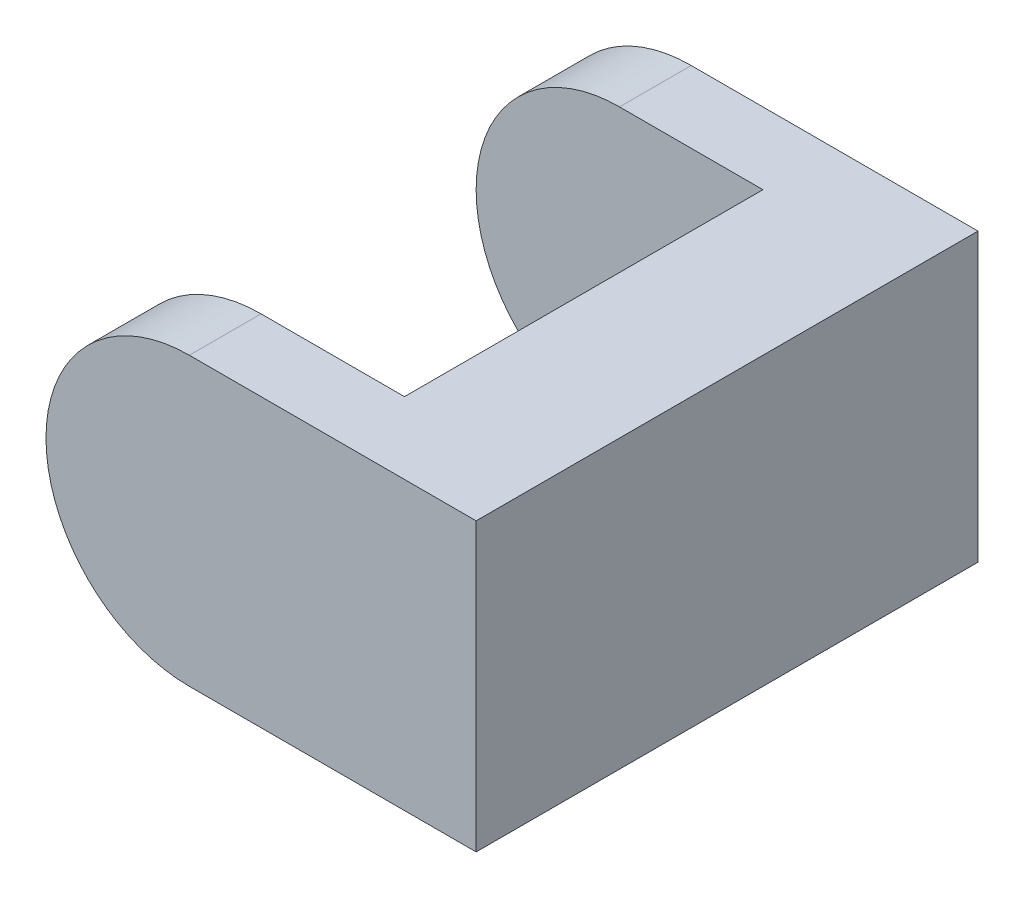
ISO-10303-21;
HEADER;
FILE_DESCRIPTION(('STEP AP214'),'2;1');
FILE_NAME('part.step','',(''),(''),'','','');
FILE_SCHEMA(('AUTOMOTIVE_DESIGN { 1 0 10303 214 1 1 1 1 }'));
ENDSEC;
DATA;
#1=APPLICATION_CONTEXT('core data for automotive mechanical design processes');
#2=APPLICATION_PROTOCOL_DEFINITION('international standard','automotive_design',2000,#1);
#3=PRODUCT_CONTEXT('',#1,'mechanical');
#4=PRODUCT('Part','Part','',(#3));
#5=PRODUCT_RELATED_PRODUCT_CATEGORY('part','',(#4));
#6=PRODUCT_DEFINITION_FORMATION('','',#4);
#7=PRODUCT_DEFINITION_CONTEXT('part definition',#1,'design');
#8=PRODUCT_DEFINITION('design','',#6,#7);
#9=PRODUCT_DEFINITION_SHAPE('','',#8);
#10=(LENGTH_UNIT() NAMED_UNIT(*) SI_UNIT(.MILLI.,.METRE.));
#11=(NAMED_UNIT(*) PLANE_ANGLE_UNIT() SI_UNIT($,.RADIAN.));
#12=(NAMED_UNIT(*) SI_UNIT($,.STERADIAN.) SOLID_ANGLE_UNIT());
#13=UNCERTAINTY_MEASURE_WITH_UNIT(LENGTH_MEASURE(1.E-05),#10,'distance_accuracy_value','');
#14=(GEOMETRIC_REPRESENTATION_CONTEXT(3) GLOBAL_UNCERTAINTY_ASSIGNED_CONTEXT((#13)) GLOBAL_UNIT_ASSIGNED_CONTEXT((#10,
#11,#12)) REPRESENTATION_CONTEXT('',''));
#15=CARTESIAN_POINT('',(0.,0.,0.));
#16=DIRECTION('',(0.,0.,1.));
#17=DIRECTION('',(1.,0.,0.));
#18=AXIS2_PLACEMENT_3D('',#15,#16,#17);
#19=CARTESIAN_POINT('',(-40.,0.,140.));
#20=DIRECTION('',(0.,0.,-1.));
#21=DIRECTION('',(-1.,0.,0.));
#22=AXIS2_PLACEMENT_3D('',#19,#20,#21);
#23=CYLINDRICAL_SURFACE('',#22,40.);
#24=DIRECTION('',(0.,0.,-1.));
#25=VECTOR('',#24,1.);
#26=CARTESIAN_POINT('',(-40.,40.,140.));
#27=LINE('',#26,#25);
#28=CARTESIAN_POINT('',(-40.,40.,140.));
#29=VERTEX_POINT('',#28);
#30=CARTESIAN_POINT('',(-40.,40.,120.));
#31=VERTEX_POINT('',#30);
#32=EDGE_CURVE('E176',#29,#31,#27,.T.);
#33=ORIENTED_EDGE('',*,*,#32,.T.);
#34=CARTESIAN_POINT('',(-40.,0.,120.));
#35=DIRECTION('',(0.,0.,1.));
#36=DIRECTION('',(1.,0.,0.));
#37=AXIS2_PLACEMENT_3D('',#34,#35,#36);
#38=CIRCLE('',#37,40.);
#39=CARTESIAN_POINT('',(-40.,-40.,120.));
#40=VERTEX_POINT('',#39);
#41=EDGE_CURVE('E128',#31,#40,#38,.T.);
#42=ORIENTED_EDGE('',*,*,#41,.T.);
#43=DIRECTION('',(0.,0.,-1.));
#44=VECTOR('',#43,1.);
#45=CARTESIAN_POINT('',(-40.,-40.,140.));
#46=LINE('',#45,#44);
#47=CARTESIAN_POINT('',(-40.,-40.,140.));
#48=VERTEX_POINT('',#47);
#49=EDGE_CURVE('E48',#48,#40,#46,.T.);
#50=ORIENTED_EDGE('',*,*,#49,.F.);
#51=CARTESIAN_POINT('',(-40.,0.,140.));
#52=DIRECTION('',(0.,0.,1.));
#53=DIRECTION('',(1.,0.,0.));
#54=AXIS2_PLACEMENT_3D('',#51,#52,#53);
#55=CIRCLE('',#54,40.);
#56=EDGE_CURVE('E155',#29,#48,#55,.T.);
#57=ORIENTED_EDGE('',*,*,#56,.F.);
#58=EDGE_LOOP('',(#33,#42,#50,#57));
#59=FACE_BOUND('',#58,.T.);
#60=ADVANCED_FACE('F39',(#59),#23,.T.);
#61=CARTESIAN_POINT('',(-40.,-40.,20.));
#62=VERTEX_POINT('',#61);
#63=CARTESIAN_POINT('',(-40.,-40.,0.));
#64=VERTEX_POINT('',#63);
#65=EDGE_CURVE('E186',#62,#64,#46,.T.);
#66=ORIENTED_EDGE('',*,*,#65,.F.);
#67=CARTESIAN_POINT('',(-40.,0.,20.));
#68=DIRECTION('',(0.,0.,-1.));
#69=DIRECTION('',(-1.,0.,0.));
#70=AXIS2_PLACEMENT_3D('',#67,#68,#69);
#71=CIRCLE('',#70,40.);
#72=CARTESIAN_POINT('',(-40.,40.,20.));
#73=VERTEX_POINT('',#72);
#74=EDGE_CURVE('E144',#62,#73,#71,.T.);
#75=ORIENTED_EDGE('',*,*,#74,.T.);
#76=CARTESIAN_POINT('',(-40.,40.,0.));
#77=VERTEX_POINT('',#76);
#78=EDGE_CURVE('E86',#73,#77,#27,.T.);
#79=ORIENTED_EDGE('',*,*,#78,.T.);
#80=CARTESIAN_POINT('',(-40.,0.,0.));
#81=DIRECTION('',(0.,0.,1.));
#82=DIRECTION('',(1.,0.,0.));
#83=AXIS2_PLACEMENT_3D('',#80,#81,#82);
#84=CIRCLE('',#83,40.);
#85=EDGE_CURVE('E154',#77,#64,#84,.T.);
#86=ORIENTED_EDGE('',*,*,#85,.T.);
#87=EDGE_LOOP('',(#66,#75,#79,#86));
#88=FACE_BOUND('',#87,.T.);
#89=ADVANCED_FACE('F41',(#88),#23,.T.);
#90=CARTESIAN_POINT('',(40.,-40.,140.));
#91=DIRECTION('',(0.,1.,0.));
#92=DIRECTION('',(0.,0.,1.));
#93=AXIS2_PLACEMENT_3D('',#90,#91,#92);
#94=PLANE('',#93);
#95=ORIENTED_EDGE('',*,*,#49,.T.);
#96=DIRECTION('',(1.,0.,0.));
#97=VECTOR('',#96,1.);
#98=CARTESIAN_POINT('',(40.,-40.,120.));
#99=LINE('',#98,#97);
#100=CARTESIAN_POINT('',(0.,-40.,120.));
#101=VERTEX_POINT('',#100);
#102=EDGE_CURVE('E147',#40,#101,#99,.T.);
#103=ORIENTED_EDGE('',*,*,#102,.T.);
#104=DIRECTION('',(0.,0.,-1.));
#105=VECTOR('',#104,1.);
#106=CARTESIAN_POINT('',(0.,-40.,140.));
#107=LINE('',#106,#105);
#108=CARTESIAN_POINT('',(0.,-40.,20.));
#109=VERTEX_POINT('',#108);
#110=EDGE_CURVE('E119',#101,#109,#107,.T.);
#111=ORIENTED_EDGE('',*,*,#110,.T.);
#112=DIRECTION('',(-1.,0.,0.));
#113=VECTOR('',#112,1.);
#114=CARTESIAN_POINT('',(40.,-40.,20.));
#115=LINE('',#114,#113);
#116=EDGE_CURVE('E123',#109,#62,#115,.T.);
#117=ORIENTED_EDGE('',*,*,#116,.T.);
#118=ORIENTED_EDGE('',*,*,#65,.T.);
#119=DIRECTION('',(1.,0.,0.));
#120=VECTOR('',#119,1.);
#121=CARTESIAN_POINT('',(40.,-40.,0.));
#122=LINE('',#121,#120);
#123=CARTESIAN_POINT('',(40.,-40.,0.));
#124=VERTEX_POINT('',#123);
#125=EDGE_CURVE('E168',#64,#124,#122,.T.);
#126=ORIENTED_EDGE('',*,*,#125,.T.);
#127=DIRECTION('',(0.,0.,-1.));
#128=VECTOR('',#127,1.);
#129=CARTESIAN_POINT('',(40.,-40.,140.));
#130=LINE('',#129,#128);
#131=CARTESIAN_POINT('',(40.,-40.,140.));
#132=VERTEX_POINT('',#131);
#133=EDGE_CURVE('E183',#132,#124,#130,.T.);
#134=ORIENTED_EDGE('',*,*,#133,.F.);
#135=DIRECTION('',(1.,0.,0.));
#136=VECTOR('',#135,1.);
#137=CARTESIAN_POINT('',(40.,-40.,140.));
#138=LINE('',#137,#136);
#139=EDGE_CURVE('E94',#48,#132,#138,.T.);
#140=ORIENTED_EDGE('',*,*,#139,.F.);
#141=EDGE_LOOP('',(#95,#103,#111,#117,#118,#126,#134,#140));
#142=FACE_BOUND('',#141,.T.);
#143=ADVANCED_FACE('F192',(#142),#94,.F.);
#144=CARTESIAN_POINT('',(40.,40.,140.));
#145=DIRECTION('',(-1.,0.,0.));
#146=DIRECTION('',(0.,0.,1.));
#147=AXIS2_PLACEMENT_3D('',#144,#145,#146);
#148=PLANE('',#147);
#149=DIRECTION('',(0.,1.,0.));
#150=VECTOR('',#149,1.);
#151=CARTESIAN_POINT('',(40.,40.,0.));
#152=LINE('',#151,#150);
#153=CARTESIAN_POINT('',(40.,40.,0.));
#154=VERTEX_POINT('',#153);
#155=EDGE_CURVE('E171',#124,#154,#152,.T.);
#156=ORIENTED_EDGE('',*,*,#155,.T.);
#157=DIRECTION('',(0.,0.,-1.));
#158=VECTOR('',#157,1.);
#159=CARTESIAN_POINT('',(40.,40.,140.));
#160=LINE('',#159,#158);
#161=CARTESIAN_POINT('',(40.,40.,140.));
#162=VERTEX_POINT('',#161);
#163=EDGE_CURVE('E179',#162,#154,#160,.T.);
#164=ORIENTED_EDGE('',*,*,#163,.F.);
#165=DIRECTION('',(0.,1.,0.));
#166=VECTOR('',#165,1.);
#167=CARTESIAN_POINT('',(40.,40.,140.));
#168=LINE('',#167,#166);
#169=EDGE_CURVE('E161',#132,#162,#168,.T.);
#170=ORIENTED_EDGE('',*,*,#169,.F.);
#171=ORIENTED_EDGE('',*,*,#133,.T.);
#172=EDGE_LOOP('',(#156,#164,#170,#171));
#173=FACE_BOUND('',#172,.T.);
#174=ADVANCED_FACE('F203',(#173),#148,.F.);
#175=CARTESIAN_POINT('',(40.,40.,140.));
#176=DIRECTION('',(0.,-1.,0.));
#177=DIRECTION('',(0.,0.,-1.));
#178=AXIS2_PLACEMENT_3D('',#175,#176,#177);
#179=PLANE('',#178);
#180=DIRECTION('',(0.,0.,-1.));
#181=VECTOR('',#180,1.);
#182=CARTESIAN_POINT('',(0.,40.,20.));
#183=LINE('',#182,#181);
#184=CARTESIAN_POINT('',(0.,40.,120.));
#185=VERTEX_POINT('',#184);
#186=CARTESIAN_POINT('',(0.,40.,20.));
#187=VERTEX_POINT('',#186);
#188=EDGE_CURVE('E55',#185,#187,#183,.T.);
#189=ORIENTED_EDGE('',*,*,#188,.F.);
#190=DIRECTION('',(-1.,0.,0.));
#191=VECTOR('',#190,1.);
#192=CARTESIAN_POINT('',(40.,40.,120.));
#193=LINE('',#192,#191);
#194=EDGE_CURVE('E11',#185,#31,#193,.T.);
#195=ORIENTED_EDGE('',*,*,#194,.T.);
#196=ORIENTED_EDGE('',*,*,#32,.F.);
#197=DIRECTION('',(-1.,0.,0.));
#198=VECTOR('',#197,1.);
#199=CARTESIAN_POINT('',(40.,40.,140.));
#200=LINE('',#199,#198);
#201=EDGE_CURVE('E64',#162,#29,#200,.T.);
#202=ORIENTED_EDGE('',*,*,#201,.F.);
#203=ORIENTED_EDGE('',*,*,#163,.T.);
#204=DIRECTION('',(-1.,0.,0.));
#205=VECTOR('',#204,1.);
#206=CARTESIAN_POINT('',(40.,40.,0.));
#207=LINE('',#206,#205);
#208=EDGE_CURVE('E158',#154,#77,#207,.T.);
#209=ORIENTED_EDGE('',*,*,#208,.T.);
#210=ORIENTED_EDGE('',*,*,#78,.F.);
#211=DIRECTION('',(-1.,0.,0.));
#212=VECTOR('',#211,1.);
#213=CARTESIAN_POINT('',(-160.,40.,20.));
#214=LINE('',#213,#212);
#215=EDGE_CURVE('E133',#187,#73,#214,.T.);
#216=ORIENTED_EDGE('',*,*,#215,.F.);
#217=EDGE_LOOP('',(#189,#195,#196,#202,#203,#209,#210,#216));
#218=FACE_BOUND('',#217,.T.);
#219=ADVANCED_FACE('F132',(#218),#179,.F.);
#220=CARTESIAN_POINT('',(-40.,0.,140.));
#221=DIRECTION('',(0.,0.,1.));
#222=DIRECTION('',(1.,0.,0.));
#223=AXIS2_PLACEMENT_3D('',#220,#221,#222);
#224=PLANE('',#223);
#225=ORIENTED_EDGE('',*,*,#56,.T.);
#226=ORIENTED_EDGE('',*,*,#139,.T.);
#227=ORIENTED_EDGE('',*,*,#169,.T.);
#228=ORIENTED_EDGE('',*,*,#201,.T.);
#229=EDGE_LOOP('',(#225,#226,#227,#228));
#230=FACE_BOUND('',#229,.T.);
#231=ADVANCED_FACE('F211',(#230),#224,.T.);
#232=CARTESIAN_POINT('',(-40.,0.,0.));
#233=DIRECTION('',(0.,0.,1.));
#234=DIRECTION('',(1.,0.,0.));
#235=AXIS2_PLACEMENT_3D('',#232,#233,#234);
#236=PLANE('',#235);
#237=ORIENTED_EDGE('',*,*,#85,.F.);
#238=ORIENTED_EDGE('',*,*,#208,.F.);
#239=ORIENTED_EDGE('',*,*,#155,.F.);
#240=ORIENTED_EDGE('',*,*,#125,.F.);
#241=EDGE_LOOP('',(#237,#238,#239,#240));
#242=FACE_BOUND('',#241,.T.);
#243=ADVANCED_FACE('F196',(#242),#236,.F.);
#244=CARTESIAN_POINT('',(0.,-100.,20.));
#245=DIRECTION('',(1.,0.,0.));
#246=DIRECTION('',(0.,0.,-1.));
#247=AXIS2_PLACEMENT_3D('',#244,#245,#246);
#248=PLANE('',#247);
#249=DIRECTION('',(0.,1.,0.));
#250=VECTOR('',#249,1.);
#251=CARTESIAN_POINT('',(0.,-100.,120.));
#252=LINE('',#251,#250);
#253=EDGE_CURVE('E115',#101,#185,#252,.T.);
#254=ORIENTED_EDGE('',*,*,#253,.T.);
#255=ORIENTED_EDGE('',*,*,#188,.T.);
#256=DIRECTION('',(0.,1.,0.));
#257=VECTOR('',#256,1.);
#258=CARTESIAN_POINT('',(0.,-100.,20.));
#259=LINE('',#258,#257);
#260=EDGE_CURVE('E124',#109,#187,#259,.T.);
#261=ORIENTED_EDGE('',*,*,#260,.F.);
#262=ORIENTED_EDGE('',*,*,#110,.F.);
#263=EDGE_LOOP('',(#254,#255,#261,#262));
#264=FACE_BOUND('',#263,.T.);
#265=ADVANCED_FACE('F117',(#264),#248,.F.);
#266=CARTESIAN_POINT('',(-160.,-100.,120.));
#267=DIRECTION('',(0.,0.,1.));
#268=DIRECTION('',(1.,0.,0.));
#269=AXIS2_PLACEMENT_3D('',#266,#267,#268);
#270=PLANE('',#269);
#271=ORIENTED_EDGE('',*,*,#194,.F.);
#272=ORIENTED_EDGE('',*,*,#253,.F.);
#273=ORIENTED_EDGE('',*,*,#102,.F.);
#274=ORIENTED_EDGE('',*,*,#41,.F.);
#275=EDGE_LOOP('',(#271,#272,#273,#274));
#276=FACE_BOUND('',#275,.T.);
#277=ADVANCED_FACE('F126',(#276),#270,.F.);
#278=CARTESIAN_POINT('',(-160.,-100.,20.));
#279=DIRECTION('',(0.,0.,-1.));
#280=DIRECTION('',(-1.,0.,0.));
#281=AXIS2_PLACEMENT_3D('',#278,#279,#280);
#282=PLANE('',#281);
#283=ORIENTED_EDGE('',*,*,#116,.F.);
#284=ORIENTED_EDGE('',*,*,#260,.T.);
#285=ORIENTED_EDGE('',*,*,#215,.T.);
#286=ORIENTED_EDGE('',*,*,#74,.F.);
#287=EDGE_LOOP('',(#283,#284,#285,#286));
#288=FACE_BOUND('',#287,.T.);
#289=ADVANCED_FACE('F252',(#288),#282,.F.);
#290=CLOSED_SHELL('',(#60,#89,#143,#174,#219,#231,#243,#265,#277,#289));
#291=MANIFOLD_SOLID_BREP('B2',#290);
#292=ADVANCED_BREP_SHAPE_REPRESENTATION('',(#18,#291),#14);
#293=SHAPE_DEFINITION_REPRESENTATION(#9,#292);
ENDSEC;
END-ISO-10303-21;
